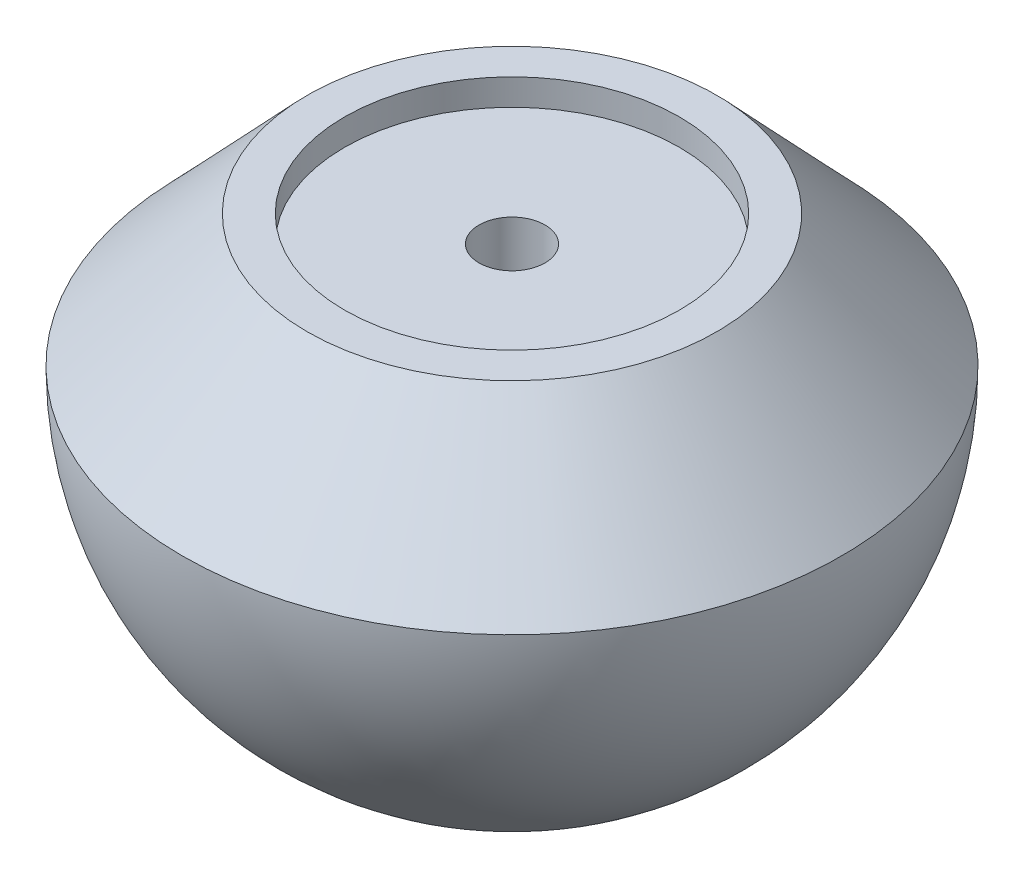
ISO-10303-21;
HEADER;
FILE_DESCRIPTION(('STEP AP214'),'2;1');
FILE_NAME('part.step','',(''),(''),'','','');
FILE_SCHEMA(('AUTOMOTIVE_DESIGN { 1 0 10303 214 1 1 1 1 }'));
ENDSEC;
DATA;
#1=APPLICATION_CONTEXT('core data for automotive mechanical design processes');
#2=APPLICATION_PROTOCOL_DEFINITION('international standard','automotive_design',2000,#1);
#3=PRODUCT_CONTEXT('',#1,'mechanical');
#4=PRODUCT('Part','Part','',(#3));
#5=PRODUCT_RELATED_PRODUCT_CATEGORY('part','',(#4));
#6=PRODUCT_DEFINITION_FORMATION('','',#4);
#7=PRODUCT_DEFINITION_CONTEXT('part definition',#1,'design');
#8=PRODUCT_DEFINITION('design','',#6,#7);
#9=PRODUCT_DEFINITION_SHAPE('','',#8);
#10=(LENGTH_UNIT() NAMED_UNIT(*) SI_UNIT(.MILLI.,.METRE.));
#11=(NAMED_UNIT(*) PLANE_ANGLE_UNIT() SI_UNIT($,.RADIAN.));
#12=(NAMED_UNIT(*) SI_UNIT($,.STERADIAN.) SOLID_ANGLE_UNIT());
#13=UNCERTAINTY_MEASURE_WITH_UNIT(LENGTH_MEASURE(1.E-05),#10,'distance_accuracy_value','');
#14=(GEOMETRIC_REPRESENTATION_CONTEXT(3) GLOBAL_UNCERTAINTY_ASSIGNED_CONTEXT((#13)) GLOBAL_UNIT_ASSIGNED_CONTEXT((#10,
#11,#12)) REPRESENTATION_CONTEXT('',''));
#15=CARTESIAN_POINT('',(0.,0.,0.));
#16=DIRECTION('',(0.,0.,1.));
#17=DIRECTION('',(1.,0.,0.));
#18=AXIS2_PLACEMENT_3D('',#15,#16,#17);
#19=CARTESIAN_POINT('',(0.,10.,0.));
#20=DIRECTION('',(0.,-1.,0.));
#21=DIRECTION('',(0.,0.,-1.));
#22=AXIS2_PLACEMENT_3D('',#19,#20,#21);
#23=CONICAL_SURFACE('',#22,15.5384615384615,0.75773723607402);
#24=CARTESIAN_POINT('',(0.,0.,0.));
#25=DIRECTION('',(0.,1.,0.));
#26=DIRECTION('',(0.,0.,1.));
#27=AXIS2_PLACEMENT_3D('',#24,#25,#26);
#28=CIRCLE('',#27,25.);
#29=CARTESIAN_POINT('',(0.,0.,25.));
#30=VERTEX_POINT('',#29);
#31=EDGE_CURVE('E59',#30,#30,#28,.T.);
#32=ORIENTED_EDGE('',*,*,#31,.T.);
#33=EDGE_LOOP('',(#32));
#34=FACE_BOUND('',#33,.T.);
#35=CARTESIAN_POINT('',(0.,10.,0.));
#36=DIRECTION('',(0.,1.,0.));
#37=DIRECTION('',(0.,0.,1.));
#38=AXIS2_PLACEMENT_3D('',#35,#36,#37);
#39=CIRCLE('',#38,15.5384615384615);
#40=CARTESIAN_POINT('',(0.,10.,15.5384615384615));
#41=VERTEX_POINT('',#40);
#42=EDGE_CURVE('E77',#41,#41,#39,.T.);
#43=ORIENTED_EDGE('',*,*,#42,.F.);
#44=EDGE_LOOP('',(#43));
#45=FACE_BOUND('',#44,.T.);
#46=ADVANCED_FACE('F39',(#34,#45),#23,.T.);
#47=CARTESIAN_POINT('',(0.,0.,0.));
#48=DIRECTION('',(0.,1.,0.));
#49=DIRECTION('',(-1.,0.,0.));
#50=AXIS2_PLACEMENT_3D('',#47,#48,#49);
#51=SPHERICAL_SURFACE('',#50,25.);
#52=CARTESIAN_POINT('',(0.,-21.9387755102041,0.));
#53=DIRECTION('',(0.,1.,0.));
#54=DIRECTION('',(0.,0.,1.));
#55=AXIS2_PLACEMENT_3D('',#52,#53,#54);
#56=CIRCLE('',#55,11.987081759664);
#57=CARTESIAN_POINT('',(0.,-21.9387755102041,11.987081759664));
#58=VERTEX_POINT('',#57);
#59=EDGE_CURVE('E54',#58,#58,#56,.T.);
#60=ORIENTED_EDGE('',*,*,#59,.T.);
#61=EDGE_LOOP('',(#60));
#62=FACE_BOUND('',#61,.T.);
#63=ORIENTED_EDGE('',*,*,#31,.F.);
#64=EDGE_LOOP('',(#63));
#65=FACE_BOUND('',#64,.T.);
#66=ADVANCED_FACE('F85',(#62,#65),#51,.T.);
#67=CARTESIAN_POINT('',(0.,-22.,0.));
#68=DIRECTION('',(0.,1.,0.));
#69=DIRECTION('',(0.,0.,1.));
#70=AXIS2_PLACEMENT_3D('',#67,#68,#69);
#71=PLANE('',#70);
#72=CARTESIAN_POINT('',(0.,-22.,0.));
#73=DIRECTION('',(0.,1.,0.));
#74=DIRECTION('',(0.,0.,1.));
#75=AXIS2_PLACEMENT_3D('',#72,#73,#74);
#76=CIRCLE('',#75,11.7473401244707);
#77=CARTESIAN_POINT('',(0.,-22.,11.7473401244707));
#78=VERTEX_POINT('',#77);
#79=EDGE_CURVE('E46',#78,#78,#76,.F.);
#80=ORIENTED_EDGE('',*,*,#79,.T.);
#81=EDGE_LOOP('',(#80));
#82=FACE_BOUND('',#81,.T.);
#83=CARTESIAN_POINT('',(0.,-22.,0.));
#84=DIRECTION('',(0.,1.,0.));
#85=DIRECTION('',(0.,0.,1.));
#86=AXIS2_PLACEMENT_3D('',#83,#84,#85);
#87=CIRCLE('',#86,5.5);
#88=CARTESIAN_POINT('',(0.,-22.,5.5));
#89=VERTEX_POINT('',#88);
#90=EDGE_CURVE('E50',#89,#89,#87,.T.);
#91=ORIENTED_EDGE('',*,*,#90,.T.);
#92=EDGE_LOOP('',(#91));
#93=FACE_BOUND('',#92,.T.);
#94=ADVANCED_FACE('F92',(#82,#93),#71,.F.);
#95=CARTESIAN_POINT('',(0.,0.,0.));
#96=DIRECTION('',(0.,1.,0.));
#97=DIRECTION('',(0.,0.,1.));
#98=AXIS2_PLACEMENT_3D('',#95,#96,#97);
#99=CYLINDRICAL_SURFACE('',#98,5.);
#100=CARTESIAN_POINT('',(0.,-21.5,0.));
#101=DIRECTION('',(0.,1.,0.));
#102=DIRECTION('',(0.,0.,1.));
#103=AXIS2_PLACEMENT_3D('',#100,#101,#102);
#104=CIRCLE('',#103,5.);
#105=CARTESIAN_POINT('',(0.,-21.5,5.));
#106=VERTEX_POINT('',#105);
#107=EDGE_CURVE('E10',#106,#106,#104,.F.);
#108=ORIENTED_EDGE('',*,*,#107,.T.);
#109=EDGE_LOOP('',(#108));
#110=FACE_BOUND('',#109,.T.);
#111=CARTESIAN_POINT('',(0.,-12.,0.));
#112=DIRECTION('',(0.,1.,0.));
#113=DIRECTION('',(0.,0.,1.));
#114=AXIS2_PLACEMENT_3D('',#111,#112,#113);
#115=CIRCLE('',#114,5.);
#116=CARTESIAN_POINT('',(0.,-12.,5.));
#117=VERTEX_POINT('',#116);
#118=EDGE_CURVE('E62',#117,#117,#115,.T.);
#119=ORIENTED_EDGE('',*,*,#118,.T.);
#120=EDGE_LOOP('',(#119));
#121=FACE_BOUND('',#120,.T.);
#122=ADVANCED_FACE('F127',(#110,#121),#99,.F.);
#123=CARTESIAN_POINT('',(0.,-12.,0.));
#124=DIRECTION('',(0.,1.,0.));
#125=DIRECTION('',(0.,0.,1.));
#126=AXIS2_PLACEMENT_3D('',#123,#124,#125);
#127=PLANE('',#126);
#128=ORIENTED_EDGE('',*,*,#118,.F.);
#129=EDGE_LOOP('',(#128));
#130=FACE_BOUND('',#129,.T.);
#131=CARTESIAN_POINT('',(0.,-12.,0.));
#132=DIRECTION('',(0.,1.,0.));
#133=DIRECTION('',(0.,0.,1.));
#134=AXIS2_PLACEMENT_3D('',#131,#132,#133);
#135=CIRCLE('',#134,2.5);
#136=CARTESIAN_POINT('',(0.,-12.,2.5));
#137=VERTEX_POINT('',#136);
#138=EDGE_CURVE('E65',#137,#137,#135,.T.);
#139=ORIENTED_EDGE('',*,*,#138,.T.);
#140=EDGE_LOOP('',(#139));
#141=FACE_BOUND('',#140,.T.);
#142=ADVANCED_FACE('F124',(#130,#141),#127,.F.);
#143=CARTESIAN_POINT('',(0.,0.,0.));
#144=DIRECTION('',(0.,1.,0.));
#145=DIRECTION('',(0.,0.,1.));
#146=AXIS2_PLACEMENT_3D('',#143,#144,#145);
#147=CYLINDRICAL_SURFACE('',#146,2.5);
#148=ORIENTED_EDGE('',*,*,#138,.F.);
#149=EDGE_LOOP('',(#148));
#150=FACE_BOUND('',#149,.T.);
#151=CARTESIAN_POINT('',(0.,8.,0.));
#152=DIRECTION('',(0.,1.,0.));
#153=DIRECTION('',(0.,0.,1.));
#154=AXIS2_PLACEMENT_3D('',#151,#152,#153);
#155=CIRCLE('',#154,2.5);
#156=CARTESIAN_POINT('',(0.,8.,2.5));
#157=VERTEX_POINT('',#156);
#158=EDGE_CURVE('E68',#157,#157,#155,.T.);
#159=ORIENTED_EDGE('',*,*,#158,.T.);
#160=EDGE_LOOP('',(#159));
#161=FACE_BOUND('',#160,.T.);
#162=ADVANCED_FACE('F120',(#150,#161),#147,.F.);
#163=CARTESIAN_POINT('',(0.,8.,0.));
#164=DIRECTION('',(0.,-1.,0.));
#165=DIRECTION('',(0.,0.,-1.));
#166=AXIS2_PLACEMENT_3D('',#163,#164,#165);
#167=PLANE('',#166);
#168=ORIENTED_EDGE('',*,*,#158,.F.);
#169=EDGE_LOOP('',(#168));
#170=FACE_BOUND('',#169,.T.);
#171=CARTESIAN_POINT('',(0.,8.,0.));
#172=DIRECTION('',(0.,1.,0.));
#173=DIRECTION('',(0.,0.,1.));
#174=AXIS2_PLACEMENT_3D('',#171,#172,#173);
#175=CIRCLE('',#174,12.7);
#176=CARTESIAN_POINT('',(0.,8.,12.7));
#177=VERTEX_POINT('',#176);
#178=EDGE_CURVE('E71',#177,#177,#175,.T.);
#179=ORIENTED_EDGE('',*,*,#178,.T.);
#180=EDGE_LOOP('',(#179));
#181=FACE_BOUND('',#180,.T.);
#182=ADVANCED_FACE('F114',(#170,#181),#167,.F.);
#183=CARTESIAN_POINT('',(0.,0.,0.));
#184=DIRECTION('',(0.,1.,0.));
#185=DIRECTION('',(0.,0.,1.));
#186=AXIS2_PLACEMENT_3D('',#183,#184,#185);
#187=CYLINDRICAL_SURFACE('',#186,12.7);
#188=ORIENTED_EDGE('',*,*,#178,.F.);
#189=EDGE_LOOP('',(#188));
#190=FACE_BOUND('',#189,.T.);
#191=CARTESIAN_POINT('',(0.,10.,0.));
#192=DIRECTION('',(0.,1.,0.));
#193=DIRECTION('',(0.,0.,1.));
#194=AXIS2_PLACEMENT_3D('',#191,#192,#193);
#195=CIRCLE('',#194,12.7);
#196=CARTESIAN_POINT('',(0.,10.,12.7));
#197=VERTEX_POINT('',#196);
#198=EDGE_CURVE('E74',#197,#197,#195,.T.);
#199=ORIENTED_EDGE('',*,*,#198,.T.);
#200=EDGE_LOOP('',(#199));
#201=FACE_BOUND('',#200,.T.);
#202=ADVANCED_FACE('F105',(#190,#201),#187,.F.);
#203=CARTESIAN_POINT('',(0.,10.,0.));
#204=DIRECTION('',(0.,1.,0.));
#205=DIRECTION('',(0.,0.,1.));
#206=AXIS2_PLACEMENT_3D('',#203,#204,#205);
#207=PLANE('',#206);
#208=ORIENTED_EDGE('',*,*,#42,.T.);
#209=EDGE_LOOP('',(#208));
#210=FACE_BOUND('',#209,.T.);
#211=ORIENTED_EDGE('',*,*,#198,.F.);
#212=EDGE_LOOP('',(#211));
#213=FACE_BOUND('',#212,.T.);
#214=ADVANCED_FACE('F81',(#210,#213),#207,.T.);
#215=CARTESIAN_POINT('',(0.,-21.5,0.));
#216=DIRECTION('',(0.,1.,0.));
#217=DIRECTION('',(0.,0.,1.));
#218=AXIS2_PLACEMENT_3D('',#215,#216,#217);
#219=TOROIDAL_SURFACE('',#218,11.7473401244707,0.5);
#220=ORIENTED_EDGE('',*,*,#79,.F.);
#221=EDGE_LOOP('',(#220));
#222=FACE_BOUND('',#221,.T.);
#223=ORIENTED_EDGE('',*,*,#59,.F.);
#224=EDGE_LOOP('',(#223));
#225=FACE_BOUND('',#224,.T.);
#226=ADVANCED_FACE('F96',(#222,#225),#219,.T.);
#227=CARTESIAN_POINT('',(0.,-21.5,0.));
#228=DIRECTION('',(0.,1.,0.));
#229=DIRECTION('',(0.,0.,1.));
#230=AXIS2_PLACEMENT_3D('',#227,#228,#229);
#231=TOROIDAL_SURFACE('',#230,5.5,0.5);
#232=ORIENTED_EDGE('',*,*,#107,.F.);
#233=EDGE_LOOP('',(#232));
#234=FACE_BOUND('',#233,.T.);
#235=ORIENTED_EDGE('',*,*,#90,.F.);
#236=EDGE_LOOP('',(#235));
#237=FACE_BOUND('',#236,.T.);
#238=ADVANCED_FACE('F41',(#234,#237),#231,.T.);
#239=CLOSED_SHELL('',(#46,#66,#94,#122,#142,#162,#182,#202,#214,#226,#238));
#240=MANIFOLD_SOLID_BREP('B2',#239);
#241=ADVANCED_BREP_SHAPE_REPRESENTATION('',(#18,#240),#14);
#242=SHAPE_DEFINITION_REPRESENTATION(#9,#241);
ENDSEC;
END-ISO-10303-21;
